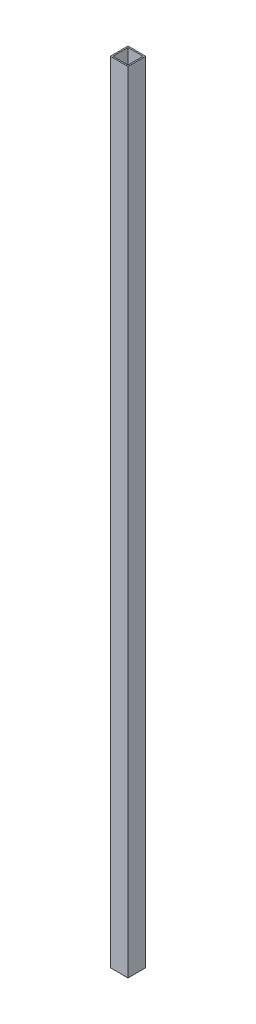
ISO-10303-21;
HEADER;
FILE_DESCRIPTION(('STEP AP214'),'2;1');
FILE_NAME('part.step','',(''),(''),'','','');
FILE_SCHEMA(('AUTOMOTIVE_DESIGN { 1 0 10303 214 1 1 1 1 }'));
ENDSEC;
DATA;
#1=APPLICATION_CONTEXT('core data for automotive mechanical design processes');
#2=APPLICATION_PROTOCOL_DEFINITION('international standard','automotive_design',2000,#1);
#3=PRODUCT_CONTEXT('',#1,'mechanical');
#4=PRODUCT('Part','Part','',(#3));
#5=PRODUCT_RELATED_PRODUCT_CATEGORY('part','',(#4));
#6=PRODUCT_DEFINITION_FORMATION('','',#4);
#7=PRODUCT_DEFINITION_CONTEXT('part definition',#1,'design');
#8=PRODUCT_DEFINITION('design','',#6,#7);
#9=PRODUCT_DEFINITION_SHAPE('','',#8);
#10=(LENGTH_UNIT() NAMED_UNIT(*) SI_UNIT(.MILLI.,.METRE.));
#11=(NAMED_UNIT(*) PLANE_ANGLE_UNIT() SI_UNIT($,.RADIAN.));
#12=(NAMED_UNIT(*) SI_UNIT($,.STERADIAN.) SOLID_ANGLE_UNIT());
#13=UNCERTAINTY_MEASURE_WITH_UNIT(LENGTH_MEASURE(1.E-05),#10,'distance_accuracy_value','');
#14=(GEOMETRIC_REPRESENTATION_CONTEXT(3) GLOBAL_UNCERTAINTY_ASSIGNED_CONTEXT((#13)) GLOBAL_UNIT_ASSIGNED_CONTEXT((#10,
#11,#12)) REPRESENTATION_CONTEXT('',''));
#15=CARTESIAN_POINT('',(0.,0.,0.));
#16=DIRECTION('',(0.,0.,1.));
#17=DIRECTION('',(1.,0.,0.));
#18=AXIS2_PLACEMENT_3D('',#15,#16,#17);
#19=CARTESIAN_POINT('',(0.,1981.2,0.));
#20=DIRECTION('',(0.,-1.,0.));
#21=DIRECTION('',(0.,0.,-1.));
#22=AXIS2_PLACEMENT_3D('',#19,#20,#21);
#23=PLANE('',#22);
#24=DIRECTION('',(0.,0.,1.));
#25=VECTOR('',#24,1.);
#26=CARTESIAN_POINT('',(0.,1981.2,0.));
#27=LINE('',#26,#25);
#28=CARTESIAN_POINT('',(0.,1981.2,-44.45));
#29=VERTEX_POINT('',#28);
#30=CARTESIAN_POINT('',(0.,1981.2,0.));
#31=VERTEX_POINT('',#30);
#32=EDGE_CURVE('E138',#29,#31,#27,.T.);
#33=ORIENTED_EDGE('',*,*,#32,.T.);
#34=DIRECTION('',(1.,0.,0.));
#35=VECTOR('',#34,1.);
#36=CARTESIAN_POINT('',(0.,1981.2,0.));
#37=LINE('',#36,#35);
#38=CARTESIAN_POINT('',(44.45,1981.2,0.));
#39=VERTEX_POINT('',#38);
#40=EDGE_CURVE('E141',#31,#39,#37,.T.);
#41=ORIENTED_EDGE('',*,*,#40,.T.);
#42=DIRECTION('',(0.,0.,-1.));
#43=VECTOR('',#42,1.);
#44=CARTESIAN_POINT('',(44.45,1981.2,0.));
#45=LINE('',#44,#43);
#46=CARTESIAN_POINT('',(44.45,1981.2,-44.45));
#47=VERTEX_POINT('',#46);
#48=EDGE_CURVE('E144',#39,#47,#45,.T.);
#49=ORIENTED_EDGE('',*,*,#48,.T.);
#50=DIRECTION('',(-1.,0.,0.));
#51=VECTOR('',#50,1.);
#52=CARTESIAN_POINT('',(0.,1981.2,-44.45));
#53=LINE('',#52,#51);
#54=EDGE_CURVE('E146',#47,#29,#53,.T.);
#55=ORIENTED_EDGE('',*,*,#54,.T.);
#56=EDGE_LOOP('',(#33,#41,#49,#55));
#57=FACE_BOUND('',#56,.T.);
#58=DIRECTION('',(1.,0.,0.));
#59=VECTOR('',#58,1.);
#60=CARTESIAN_POINT('',(3.175,1981.2,-3.175));
#61=LINE('',#60,#59);
#62=CARTESIAN_POINT('',(3.175,1981.2,-3.175));
#63=VERTEX_POINT('',#62);
#64=CARTESIAN_POINT('',(41.275,1981.2,-3.175));
#65=VERTEX_POINT('',#64);
#66=EDGE_CURVE('E102',#63,#65,#61,.T.);
#67=ORIENTED_EDGE('',*,*,#66,.F.);
#68=DIRECTION('',(0.,0.,1.));
#69=VECTOR('',#68,1.);
#70=CARTESIAN_POINT('',(3.175,1981.2,-3.175));
#71=LINE('',#70,#69);
#72=CARTESIAN_POINT('',(3.175,1981.2,-41.275));
#73=VERTEX_POINT('',#72);
#74=EDGE_CURVE('E124',#73,#63,#71,.T.);
#75=ORIENTED_EDGE('',*,*,#74,.F.);
#76=DIRECTION('',(-1.,0.,0.));
#77=VECTOR('',#76,1.);
#78=CARTESIAN_POINT('',(3.175,1981.2,-41.275));
#79=LINE('',#78,#77);
#80=CARTESIAN_POINT('',(41.275,1981.2,-41.275));
#81=VERTEX_POINT('',#80);
#82=EDGE_CURVE('E122',#81,#73,#79,.T.);
#83=ORIENTED_EDGE('',*,*,#82,.F.);
#84=DIRECTION('',(0.,0.,-1.));
#85=VECTOR('',#84,1.);
#86=CARTESIAN_POINT('',(41.275,1981.2,-3.175));
#87=LINE('',#86,#85);
#88=EDGE_CURVE('E110',#65,#81,#87,.T.);
#89=ORIENTED_EDGE('',*,*,#88,.F.);
#90=EDGE_LOOP('',(#67,#75,#83,#89));
#91=FACE_BOUND('',#90,.T.);
#92=ADVANCED_FACE('F37',(#57,#91),#23,.F.);
#93=CARTESIAN_POINT('',(0.,0.,0.));
#94=DIRECTION('',(0.,-1.,0.));
#95=DIRECTION('',(0.,0.,-1.));
#96=AXIS2_PLACEMENT_3D('',#93,#94,#95);
#97=PLANE('',#96);
#98=DIRECTION('',(0.,0.,1.));
#99=VECTOR('',#98,1.);
#100=CARTESIAN_POINT('',(0.,0.,0.));
#101=LINE('',#100,#99);
#102=CARTESIAN_POINT('',(0.,0.,-44.45));
#103=VERTEX_POINT('',#102);
#104=CARTESIAN_POINT('',(0.,0.,0.));
#105=VERTEX_POINT('',#104);
#106=EDGE_CURVE('E118',#103,#105,#101,.T.);
#107=ORIENTED_EDGE('',*,*,#106,.F.);
#108=DIRECTION('',(-1.,0.,0.));
#109=VECTOR('',#108,1.);
#110=CARTESIAN_POINT('',(0.,0.,-44.45));
#111=LINE('',#110,#109);
#112=CARTESIAN_POINT('',(44.45,0.,-44.45));
#113=VERTEX_POINT('',#112);
#114=EDGE_CURVE('E142',#113,#103,#111,.T.);
#115=ORIENTED_EDGE('',*,*,#114,.F.);
#116=DIRECTION('',(0.,0.,-1.));
#117=VECTOR('',#116,1.);
#118=CARTESIAN_POINT('',(44.45,0.,0.));
#119=LINE('',#118,#117);
#120=CARTESIAN_POINT('',(44.45,0.,0.));
#121=VERTEX_POINT('',#120);
#122=EDGE_CURVE('E153',#121,#113,#119,.T.);
#123=ORIENTED_EDGE('',*,*,#122,.F.);
#124=DIRECTION('',(1.,0.,0.));
#125=VECTOR('',#124,1.);
#126=CARTESIAN_POINT('',(0.,0.,0.));
#127=LINE('',#126,#125);
#128=EDGE_CURVE('E151',#105,#121,#127,.T.);
#129=ORIENTED_EDGE('',*,*,#128,.F.);
#130=EDGE_LOOP('',(#107,#115,#123,#129));
#131=FACE_BOUND('',#130,.T.);
#132=DIRECTION('',(0.,0.,1.));
#133=VECTOR('',#132,1.);
#134=CARTESIAN_POINT('',(3.175,0.,-3.175));
#135=LINE('',#134,#133);
#136=CARTESIAN_POINT('',(3.175,0.,-41.275));
#137=VERTEX_POINT('',#136);
#138=CARTESIAN_POINT('',(3.175,0.,-3.175));
#139=VERTEX_POINT('',#138);
#140=EDGE_CURVE('E111',#137,#139,#135,.T.);
#141=ORIENTED_EDGE('',*,*,#140,.T.);
#142=DIRECTION('',(1.,0.,0.));
#143=VECTOR('',#142,1.);
#144=CARTESIAN_POINT('',(3.175,0.,-3.175));
#145=LINE('',#144,#143);
#146=CARTESIAN_POINT('',(41.275,0.,-3.175));
#147=VERTEX_POINT('',#146);
#148=EDGE_CURVE('E60',#139,#147,#145,.T.);
#149=ORIENTED_EDGE('',*,*,#148,.T.);
#150=DIRECTION('',(0.,0.,-1.));
#151=VECTOR('',#150,1.);
#152=CARTESIAN_POINT('',(41.275,0.,-3.175));
#153=LINE('',#152,#151);
#154=CARTESIAN_POINT('',(41.275,0.,-41.275));
#155=VERTEX_POINT('',#154);
#156=EDGE_CURVE('E117',#147,#155,#153,.T.);
#157=ORIENTED_EDGE('',*,*,#156,.T.);
#158=DIRECTION('',(-1.,0.,0.));
#159=VECTOR('',#158,1.);
#160=CARTESIAN_POINT('',(3.175,0.,-41.275));
#161=LINE('',#160,#159);
#162=EDGE_CURVE('E130',#155,#137,#161,.T.);
#163=ORIENTED_EDGE('',*,*,#162,.T.);
#164=EDGE_LOOP('',(#141,#149,#157,#163));
#165=FACE_BOUND('',#164,.T.);
#166=ADVANCED_FACE('F171',(#131,#165),#97,.T.);
#167=CARTESIAN_POINT('',(0.,1981.2,0.));
#168=DIRECTION('',(1.,0.,0.));
#169=DIRECTION('',(0.,0.,-1.));
#170=AXIS2_PLACEMENT_3D('',#167,#168,#169);
#171=PLANE('',#170);
#172=ORIENTED_EDGE('',*,*,#106,.T.);
#173=DIRECTION('',(0.,-1.,0.));
#174=VECTOR('',#173,1.);
#175=CARTESIAN_POINT('',(0.,1981.2,0.));
#176=LINE('',#175,#174);
#177=EDGE_CURVE('E11',#31,#105,#176,.T.);
#178=ORIENTED_EDGE('',*,*,#177,.F.);
#179=ORIENTED_EDGE('',*,*,#32,.F.);
#180=DIRECTION('',(0.,-1.,0.));
#181=VECTOR('',#180,1.);
#182=CARTESIAN_POINT('',(0.,1981.2,-44.45));
#183=LINE('',#182,#181);
#184=EDGE_CURVE('E148',#29,#103,#183,.T.);
#185=ORIENTED_EDGE('',*,*,#184,.T.);
#186=EDGE_LOOP('',(#172,#178,#179,#185));
#187=FACE_BOUND('',#186,.T.);
#188=ADVANCED_FACE('F39',(#187),#171,.F.);
#189=CARTESIAN_POINT('',(0.,1981.2,0.));
#190=DIRECTION('',(0.,0.,-1.));
#191=DIRECTION('',(-1.,0.,0.));
#192=AXIS2_PLACEMENT_3D('',#189,#190,#191);
#193=PLANE('',#192);
#194=ORIENTED_EDGE('',*,*,#128,.T.);
#195=DIRECTION('',(0.,-1.,0.));
#196=VECTOR('',#195,1.);
#197=CARTESIAN_POINT('',(44.45,1981.2,0.));
#198=LINE('',#197,#196);
#199=EDGE_CURVE('E45',#39,#121,#198,.T.);
#200=ORIENTED_EDGE('',*,*,#199,.F.);
#201=ORIENTED_EDGE('',*,*,#40,.F.);
#202=ORIENTED_EDGE('',*,*,#177,.T.);
#203=EDGE_LOOP('',(#194,#200,#201,#202));
#204=FACE_BOUND('',#203,.T.);
#205=ADVANCED_FACE('F181',(#204),#193,.F.);
#206=CARTESIAN_POINT('',(44.45,1981.2,0.));
#207=DIRECTION('',(-1.,0.,0.));
#208=DIRECTION('',(0.,0.,1.));
#209=AXIS2_PLACEMENT_3D('',#206,#207,#208);
#210=PLANE('',#209);
#211=ORIENTED_EDGE('',*,*,#122,.T.);
#212=DIRECTION('',(0.,-1.,0.));
#213=VECTOR('',#212,1.);
#214=CARTESIAN_POINT('',(44.45,1981.2,-44.45));
#215=LINE('',#214,#213);
#216=EDGE_CURVE('E158',#47,#113,#215,.T.);
#217=ORIENTED_EDGE('',*,*,#216,.F.);
#218=ORIENTED_EDGE('',*,*,#48,.F.);
#219=ORIENTED_EDGE('',*,*,#199,.T.);
#220=EDGE_LOOP('',(#211,#217,#218,#219));
#221=FACE_BOUND('',#220,.T.);
#222=ADVANCED_FACE('F165',(#221),#210,.F.);
#223=CARTESIAN_POINT('',(0.,1981.2,-44.45));
#224=DIRECTION('',(0.,0.,1.));
#225=DIRECTION('',(1.,0.,0.));
#226=AXIS2_PLACEMENT_3D('',#223,#224,#225);
#227=PLANE('',#226);
#228=ORIENTED_EDGE('',*,*,#114,.T.);
#229=ORIENTED_EDGE('',*,*,#184,.F.);
#230=ORIENTED_EDGE('',*,*,#54,.F.);
#231=ORIENTED_EDGE('',*,*,#216,.T.);
#232=EDGE_LOOP('',(#228,#229,#230,#231));
#233=FACE_BOUND('',#232,.T.);
#234=ADVANCED_FACE('F175',(#233),#227,.F.);
#235=CARTESIAN_POINT('',(3.175,1981.2,-3.175));
#236=DIRECTION('',(0.,0.,-1.));
#237=DIRECTION('',(-1.,0.,0.));
#238=AXIS2_PLACEMENT_3D('',#235,#236,#237);
#239=PLANE('',#238);
#240=ORIENTED_EDGE('',*,*,#148,.F.);
#241=DIRECTION('',(0.,-1.,0.));
#242=VECTOR('',#241,1.);
#243=CARTESIAN_POINT('',(3.175,1981.2,-3.175));
#244=LINE('',#243,#242);
#245=EDGE_CURVE('E106',#63,#139,#244,.T.);
#246=ORIENTED_EDGE('',*,*,#245,.F.);
#247=ORIENTED_EDGE('',*,*,#66,.T.);
#248=DIRECTION('',(0.,-1.,0.));
#249=VECTOR('',#248,1.);
#250=CARTESIAN_POINT('',(41.275,1981.2,-3.175));
#251=LINE('',#250,#249);
#252=EDGE_CURVE('E105',#65,#147,#251,.T.);
#253=ORIENTED_EDGE('',*,*,#252,.T.);
#254=EDGE_LOOP('',(#240,#246,#247,#253));
#255=FACE_BOUND('',#254,.T.);
#256=ADVANCED_FACE('F104',(#255),#239,.T.);
#257=CARTESIAN_POINT('',(41.275,1981.2,-3.175));
#258=DIRECTION('',(-1.,0.,0.));
#259=DIRECTION('',(0.,0.,1.));
#260=AXIS2_PLACEMENT_3D('',#257,#258,#259);
#261=PLANE('',#260);
#262=ORIENTED_EDGE('',*,*,#156,.F.);
#263=ORIENTED_EDGE('',*,*,#252,.F.);
#264=ORIENTED_EDGE('',*,*,#88,.T.);
#265=DIRECTION('',(0.,-1.,0.));
#266=VECTOR('',#265,1.);
#267=CARTESIAN_POINT('',(41.275,1981.2,-41.275));
#268=LINE('',#267,#266);
#269=EDGE_CURVE('E119',#81,#155,#268,.T.);
#270=ORIENTED_EDGE('',*,*,#269,.T.);
#271=EDGE_LOOP('',(#262,#263,#264,#270));
#272=FACE_BOUND('',#271,.T.);
#273=ADVANCED_FACE('F114',(#272),#261,.T.);
#274=CARTESIAN_POINT('',(3.175,1981.2,-41.275));
#275=DIRECTION('',(0.,0.,1.));
#276=DIRECTION('',(1.,0.,0.));
#277=AXIS2_PLACEMENT_3D('',#274,#275,#276);
#278=PLANE('',#277);
#279=ORIENTED_EDGE('',*,*,#162,.F.);
#280=ORIENTED_EDGE('',*,*,#269,.F.);
#281=ORIENTED_EDGE('',*,*,#82,.T.);
#282=DIRECTION('',(0.,-1.,0.));
#283=VECTOR('',#282,1.);
#284=CARTESIAN_POINT('',(3.175,1981.2,-41.275));
#285=LINE('',#284,#283);
#286=EDGE_CURVE('E52',#73,#137,#285,.T.);
#287=ORIENTED_EDGE('',*,*,#286,.T.);
#288=EDGE_LOOP('',(#279,#280,#281,#287));
#289=FACE_BOUND('',#288,.T.);
#290=ADVANCED_FACE('F204',(#289),#278,.T.);
#291=CARTESIAN_POINT('',(3.175,1981.2,-3.175));
#292=DIRECTION('',(1.,0.,0.));
#293=DIRECTION('',(0.,0.,-1.));
#294=AXIS2_PLACEMENT_3D('',#291,#292,#293);
#295=PLANE('',#294);
#296=ORIENTED_EDGE('',*,*,#140,.F.);
#297=ORIENTED_EDGE('',*,*,#286,.F.);
#298=ORIENTED_EDGE('',*,*,#74,.T.);
#299=ORIENTED_EDGE('',*,*,#245,.T.);
#300=EDGE_LOOP('',(#296,#297,#298,#299));
#301=FACE_BOUND('',#300,.T.);
#302=ADVANCED_FACE('F208',(#301),#295,.T.);
#303=CLOSED_SHELL('',(#92,#166,#188,#205,#222,#234,#256,#273,#290,#302));
#304=MANIFOLD_SOLID_BREP('B2',#303);
#305=ADVANCED_BREP_SHAPE_REPRESENTATION('',(#18,#304),#14);
#306=SHAPE_DEFINITION_REPRESENTATION(#9,#305);
ENDSEC;
END-ISO-10303-21;
